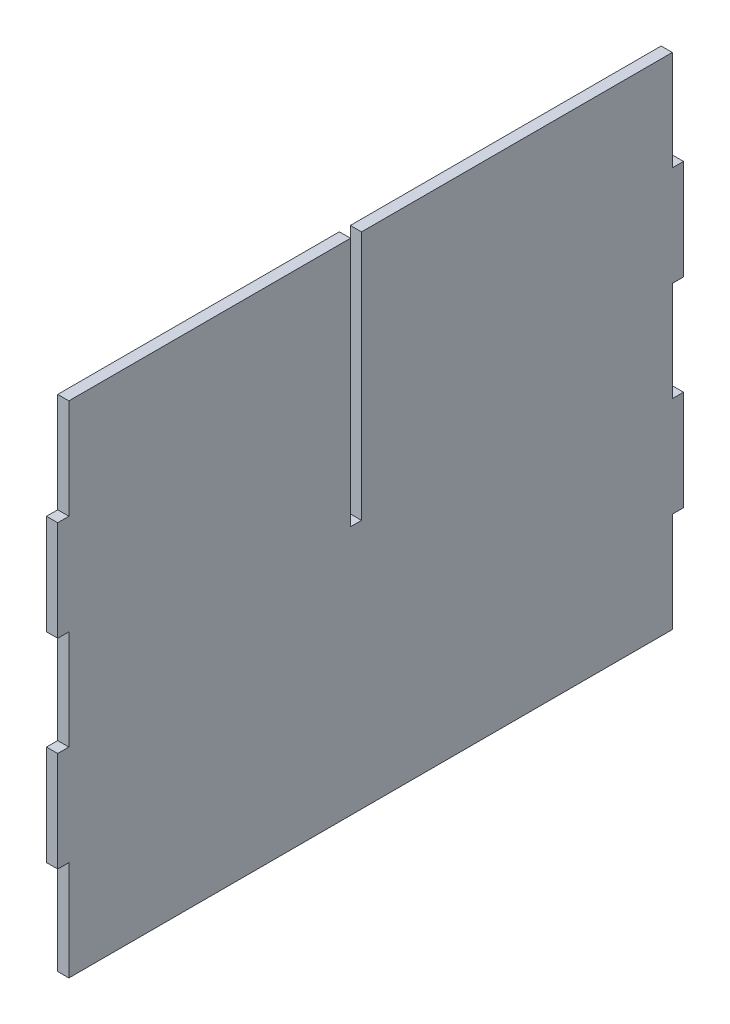
ISO-10303-21;
HEADER;
FILE_DESCRIPTION(('STEP AP214'),'2;1');
FILE_NAME('part.step','',(''),(''),'','','');
FILE_SCHEMA(('AUTOMOTIVE_DESIGN { 1 0 10303 214 1 1 1 1 }'));
ENDSEC;
DATA;
#1=APPLICATION_CONTEXT('core data for automotive mechanical design processes');
#2=APPLICATION_PROTOCOL_DEFINITION('international standard','automotive_design',2000,#1);
#3=PRODUCT_CONTEXT('',#1,'mechanical');
#4=PRODUCT('Part','Part','',(#3));
#5=PRODUCT_RELATED_PRODUCT_CATEGORY('part','',(#4));
#6=PRODUCT_DEFINITION_FORMATION('','',#4);
#7=PRODUCT_DEFINITION_CONTEXT('part definition',#1,'design');
#8=PRODUCT_DEFINITION('design','',#6,#7);
#9=PRODUCT_DEFINITION_SHAPE('','',#8);
#10=(LENGTH_UNIT() NAMED_UNIT(*) SI_UNIT(.MILLI.,.METRE.));
#11=(NAMED_UNIT(*) PLANE_ANGLE_UNIT() SI_UNIT($,.RADIAN.));
#12=(NAMED_UNIT(*) SI_UNIT($,.STERADIAN.) SOLID_ANGLE_UNIT());
#13=UNCERTAINTY_MEASURE_WITH_UNIT(LENGTH_MEASURE(1.E-05),#10,'distance_accuracy_value','');
#14=(GEOMETRIC_REPRESENTATION_CONTEXT(3) GLOBAL_UNCERTAINTY_ASSIGNED_CONTEXT((#13)) GLOBAL_UNIT_ASSIGNED_CONTEXT((#10,
#11,#12)) REPRESENTATION_CONTEXT('',''));
#15=CARTESIAN_POINT('',(0.,0.,0.));
#16=DIRECTION('',(0.,0.,1.));
#17=DIRECTION('',(1.,0.,0.));
#18=AXIS2_PLACEMENT_3D('',#15,#16,#17);
#19=CARTESIAN_POINT('',(-386.827934387987,-63.10064,148.42814));
#20=DIRECTION('',(0.,0.,1.));
#21=DIRECTION('',(1.,0.,0.));
#22=AXIS2_PLACEMENT_3D('',#19,#20,#21);
#23=PLANE('',#22);
#24=DIRECTION('',(0.,1.,0.));
#25=VECTOR('',#24,1.);
#26=CARTESIAN_POINT('',(0.,-63.10064,148.42814));
#27=LINE('',#26,#25);
#28=CARTESIAN_POINT('',(0.,-111.36564,148.42814));
#29=VERTEX_POINT('',#28);
#30=CARTESIAN_POINT('',(0.,-63.10064,148.42814));
#31=VERTEX_POINT('',#30);
#32=EDGE_CURVE('E50',#29,#31,#27,.T.);
#33=ORIENTED_EDGE('',*,*,#32,.F.);
#34=DIRECTION('',(1.,0.,0.));
#35=VECTOR('',#34,1.);
#36=CARTESIAN_POINT('',(-386.827934387987,-111.36564,148.42814));
#37=LINE('',#36,#35);
#38=CARTESIAN_POINT('',(5.4,-111.36564,148.42814));
#39=VERTEX_POINT('',#38);
#40=EDGE_CURVE('E201',#29,#39,#37,.T.);
#41=ORIENTED_EDGE('',*,*,#40,.T.);
#42=DIRECTION('',(0.,-1.,0.));
#43=VECTOR('',#42,1.);
#44=CARTESIAN_POINT('',(5.4,-63.10064,148.42814));
#45=LINE('',#44,#43);
#46=CARTESIAN_POINT('',(5.4,-63.10064,148.42814));
#47=VERTEX_POINT('',#46);
#48=EDGE_CURVE('E205',#47,#39,#45,.T.);
#49=ORIENTED_EDGE('',*,*,#48,.F.);
#50=DIRECTION('',(1.,0.,0.));
#51=VECTOR('',#50,1.);
#52=CARTESIAN_POINT('',(-386.827934387987,-63.10064,148.42814));
#53=LINE('',#52,#51);
#54=EDGE_CURVE('E313',#31,#47,#53,.T.);
#55=ORIENTED_EDGE('',*,*,#54,.F.);
#56=EDGE_LOOP('',(#33,#41,#49,#55));
#57=FACE_BOUND('',#56,.T.);
#58=ADVANCED_FACE('F41',(#57),#23,.T.);
#59=CARTESIAN_POINT('',(-386.827934387987,-63.10064,153.82814));
#60=DIRECTION('',(0.,-1.,0.));
#61=DIRECTION('',(0.,0.,-1.));
#62=AXIS2_PLACEMENT_3D('',#59,#60,#61);
#63=PLANE('',#62);
#64=DIRECTION('',(0.,0.,1.));
#65=VECTOR('',#64,1.);
#66=CARTESIAN_POINT('',(0.,-63.10064,153.82814));
#67=LINE('',#66,#65);
#68=CARTESIAN_POINT('',(0.,-63.10064,153.82814));
#69=VERTEX_POINT('',#68);
#70=EDGE_CURVE('E441',#31,#69,#67,.T.);
#71=ORIENTED_EDGE('',*,*,#70,.F.);
#72=ORIENTED_EDGE('',*,*,#54,.T.);
#73=DIRECTION('',(0.,0.,-1.));
#74=VECTOR('',#73,1.);
#75=CARTESIAN_POINT('',(5.4,-63.10064,153.82814));
#76=LINE('',#75,#74);
#77=CARTESIAN_POINT('',(5.4,-63.10064,153.82814));
#78=VERTEX_POINT('',#77);
#79=EDGE_CURVE('E211',#78,#47,#76,.T.);
#80=ORIENTED_EDGE('',*,*,#79,.F.);
#81=DIRECTION('',(1.,0.,0.));
#82=VECTOR('',#81,1.);
#83=CARTESIAN_POINT('',(-386.827934387987,-63.10064,153.82814));
#84=LINE('',#83,#82);
#85=EDGE_CURVE('E317',#69,#78,#84,.T.);
#86=ORIENTED_EDGE('',*,*,#85,.F.);
#87=EDGE_LOOP('',(#71,#72,#80,#86));
#88=FACE_BOUND('',#87,.T.);
#89=ADVANCED_FACE('F448',(#88),#63,.T.);
#90=CARTESIAN_POINT('',(-386.827934387987,-14.75436,153.82814));
#91=DIRECTION('',(0.,0.,1.));
#92=DIRECTION('',(1.,0.,0.));
#93=AXIS2_PLACEMENT_3D('',#90,#91,#92);
#94=PLANE('',#93);
#95=DIRECTION('',(0.,1.,0.));
#96=VECTOR('',#95,1.);
#97=CARTESIAN_POINT('',(0.,-14.75436,153.82814));
#98=LINE('',#97,#96);
#99=CARTESIAN_POINT('',(0.,-14.75436,153.82814));
#100=VERTEX_POINT('',#99);
#101=EDGE_CURVE('E438',#69,#100,#98,.T.);
#102=ORIENTED_EDGE('',*,*,#101,.F.);
#103=ORIENTED_EDGE('',*,*,#85,.T.);
#104=DIRECTION('',(0.,-1.,0.));
#105=VECTOR('',#104,1.);
#106=CARTESIAN_POINT('',(5.4,-14.75436,153.82814));
#107=LINE('',#106,#105);
#108=CARTESIAN_POINT('',(5.4,-14.75436,153.82814));
#109=VERTEX_POINT('',#108);
#110=EDGE_CURVE('E308',#109,#78,#107,.T.);
#111=ORIENTED_EDGE('',*,*,#110,.F.);
#112=DIRECTION('',(1.,0.,0.));
#113=VECTOR('',#112,1.);
#114=CARTESIAN_POINT('',(-386.827934387987,-14.75436,153.82814));
#115=LINE('',#114,#113);
#116=EDGE_CURVE('E320',#100,#109,#115,.T.);
#117=ORIENTED_EDGE('',*,*,#116,.F.);
#118=EDGE_LOOP('',(#102,#103,#111,#117));
#119=FACE_BOUND('',#118,.T.);
#120=ADVANCED_FACE('F451',(#119),#94,.T.);
#121=CARTESIAN_POINT('',(-386.827934387987,-14.75436,148.42814));
#122=DIRECTION('',(0.,1.,0.));
#123=DIRECTION('',(0.,0.,1.));
#124=AXIS2_PLACEMENT_3D('',#121,#122,#123);
#125=PLANE('',#124);
#126=DIRECTION('',(0.,0.,-1.));
#127=VECTOR('',#126,1.);
#128=CARTESIAN_POINT('',(0.,-14.75436,148.42814));
#129=LINE('',#128,#127);
#130=CARTESIAN_POINT('',(0.,-14.75436,148.42814));
#131=VERTEX_POINT('',#130);
#132=EDGE_CURVE('E435',#100,#131,#129,.T.);
#133=ORIENTED_EDGE('',*,*,#132,.F.);
#134=ORIENTED_EDGE('',*,*,#116,.T.);
#135=DIRECTION('',(0.,0.,1.));
#136=VECTOR('',#135,1.);
#137=CARTESIAN_POINT('',(5.4,-14.75436,148.42814));
#138=LINE('',#137,#136);
#139=CARTESIAN_POINT('',(5.4,-14.75436,148.42814));
#140=VERTEX_POINT('',#139);
#141=EDGE_CURVE('E304',#140,#109,#138,.T.);
#142=ORIENTED_EDGE('',*,*,#141,.F.);
#143=DIRECTION('',(1.,0.,0.));
#144=VECTOR('',#143,1.);
#145=CARTESIAN_POINT('',(-386.827934387987,-14.75436,148.42814));
#146=LINE('',#145,#144);
#147=EDGE_CURVE('E323',#131,#140,#146,.T.);
#148=ORIENTED_EDGE('',*,*,#147,.F.);
#149=EDGE_LOOP('',(#133,#134,#142,#148));
#150=FACE_BOUND('',#149,.T.);
#151=ADVANCED_FACE('F458',(#150),#125,.T.);
#152=CARTESIAN_POINT('',(-386.827934387987,33.42936,148.42814));
#153=DIRECTION('',(0.,0.,1.));
#154=DIRECTION('',(1.,0.,0.));
#155=AXIS2_PLACEMENT_3D('',#152,#153,#154);
#156=PLANE('',#155);
#157=DIRECTION('',(0.,1.,0.));
#158=VECTOR('',#157,1.);
#159=CARTESIAN_POINT('',(0.,33.42936,148.42814));
#160=LINE('',#159,#158);
#161=CARTESIAN_POINT('',(0.,33.42936,148.42814));
#162=VERTEX_POINT('',#161);
#163=EDGE_CURVE('E432',#131,#162,#160,.T.);
#164=ORIENTED_EDGE('',*,*,#163,.F.);
#165=ORIENTED_EDGE('',*,*,#147,.T.);
#166=DIRECTION('',(0.,-1.,0.));
#167=VECTOR('',#166,1.);
#168=CARTESIAN_POINT('',(5.4,33.42936,148.42814));
#169=LINE('',#168,#167);
#170=CARTESIAN_POINT('',(5.4,33.42936,148.42814));
#171=VERTEX_POINT('',#170);
#172=EDGE_CURVE('E300',#171,#140,#169,.T.);
#173=ORIENTED_EDGE('',*,*,#172,.F.);
#174=DIRECTION('',(1.,0.,0.));
#175=VECTOR('',#174,1.);
#176=CARTESIAN_POINT('',(-386.827934387987,33.42936,148.42814));
#177=LINE('',#176,#175);
#178=EDGE_CURVE('E326',#162,#171,#177,.T.);
#179=ORIENTED_EDGE('',*,*,#178,.F.);
#180=EDGE_LOOP('',(#164,#165,#173,#179));
#181=FACE_BOUND('',#180,.T.);
#182=ADVANCED_FACE('F463',(#181),#156,.T.);
#183=CARTESIAN_POINT('',(-386.827934387987,33.42936,153.82814));
#184=DIRECTION('',(0.,-1.,0.));
#185=DIRECTION('',(0.,0.,-1.));
#186=AXIS2_PLACEMENT_3D('',#183,#184,#185);
#187=PLANE('',#186);
#188=DIRECTION('',(0.,0.,1.));
#189=VECTOR('',#188,1.);
#190=CARTESIAN_POINT('',(0.,33.42936,153.82814));
#191=LINE('',#190,#189);
#192=CARTESIAN_POINT('',(0.,33.42936,153.82814));
#193=VERTEX_POINT('',#192);
#194=EDGE_CURVE('E429',#162,#193,#191,.T.);
#195=ORIENTED_EDGE('',*,*,#194,.F.);
#196=ORIENTED_EDGE('',*,*,#178,.T.);
#197=DIRECTION('',(0.,0.,-1.));
#198=VECTOR('',#197,1.);
#199=CARTESIAN_POINT('',(5.4,33.42936,153.82814));
#200=LINE('',#199,#198);
#201=CARTESIAN_POINT('',(5.4,33.42936,153.82814));
#202=VERTEX_POINT('',#201);
#203=EDGE_CURVE('E296',#202,#171,#200,.T.);
#204=ORIENTED_EDGE('',*,*,#203,.F.);
#205=DIRECTION('',(1.,0.,0.));
#206=VECTOR('',#205,1.);
#207=CARTESIAN_POINT('',(-386.827934387987,33.42936,153.82814));
#208=LINE('',#207,#206);
#209=EDGE_CURVE('E329',#193,#202,#208,.T.);
#210=ORIENTED_EDGE('',*,*,#209,.F.);
#211=EDGE_LOOP('',(#195,#196,#204,#210));
#212=FACE_BOUND('',#211,.T.);
#213=ADVANCED_FACE('F466',(#212),#187,.T.);
#214=CARTESIAN_POINT('',(-386.827934387987,81.77564,153.82814));
#215=DIRECTION('',(0.,0.,1.));
#216=DIRECTION('',(0.,-1.,0.));
#217=AXIS2_PLACEMENT_3D('',#214,#215,#216);
#218=PLANE('',#217);
#219=DIRECTION('',(0.,1.,0.));
#220=VECTOR('',#219,1.);
#221=CARTESIAN_POINT('',(0.,81.77564,153.82814));
#222=LINE('',#221,#220);
#223=CARTESIAN_POINT('',(0.,81.77564,153.82814));
#224=VERTEX_POINT('',#223);
#225=EDGE_CURVE('E426',#193,#224,#222,.T.);
#226=ORIENTED_EDGE('',*,*,#225,.F.);
#227=ORIENTED_EDGE('',*,*,#209,.T.);
#228=DIRECTION('',(0.,-1.,0.));
#229=VECTOR('',#228,1.);
#230=CARTESIAN_POINT('',(5.4,81.77564,153.82814));
#231=LINE('',#230,#229);
#232=CARTESIAN_POINT('',(5.4,81.77564,153.82814));
#233=VERTEX_POINT('',#232);
#234=EDGE_CURVE('E292',#233,#202,#231,.T.);
#235=ORIENTED_EDGE('',*,*,#234,.F.);
#236=DIRECTION('',(1.,0.,0.));
#237=VECTOR('',#236,1.);
#238=CARTESIAN_POINT('',(-386.827934387987,81.77564,153.82814));
#239=LINE('',#238,#237);
#240=EDGE_CURVE('E332',#224,#233,#239,.T.);
#241=ORIENTED_EDGE('',*,*,#240,.F.);
#242=EDGE_LOOP('',(#226,#227,#235,#241));
#243=FACE_BOUND('',#242,.T.);
#244=ADVANCED_FACE('F472',(#243),#218,.T.);
#245=CARTESIAN_POINT('',(-386.827934387987,81.77564,148.42814));
#246=DIRECTION('',(0.,1.,0.));
#247=DIRECTION('',(0.,0.,1.));
#248=AXIS2_PLACEMENT_3D('',#245,#246,#247);
#249=PLANE('',#248);
#250=DIRECTION('',(0.,0.,-1.));
#251=VECTOR('',#250,1.);
#252=CARTESIAN_POINT('',(0.,81.77564,148.42814));
#253=LINE('',#252,#251);
#254=CARTESIAN_POINT('',(0.,81.77564,148.42814));
#255=VERTEX_POINT('',#254);
#256=EDGE_CURVE('E423',#224,#255,#253,.T.);
#257=ORIENTED_EDGE('',*,*,#256,.F.);
#258=ORIENTED_EDGE('',*,*,#240,.T.);
#259=DIRECTION('',(0.,0.,1.));
#260=VECTOR('',#259,1.);
#261=CARTESIAN_POINT('',(5.4,81.77564,148.42814));
#262=LINE('',#261,#260);
#263=CARTESIAN_POINT('',(5.4,81.77564,148.42814));
#264=VERTEX_POINT('',#263);
#265=EDGE_CURVE('E288',#264,#233,#262,.T.);
#266=ORIENTED_EDGE('',*,*,#265,.F.);
#267=DIRECTION('',(1.,0.,0.));
#268=VECTOR('',#267,1.);
#269=CARTESIAN_POINT('',(-386.827934387987,81.77564,148.42814));
#270=LINE('',#269,#268);
#271=EDGE_CURVE('E335',#255,#264,#270,.T.);
#272=ORIENTED_EDGE('',*,*,#271,.F.);
#273=EDGE_LOOP('',(#257,#258,#266,#272));
#274=FACE_BOUND('',#273,.T.);
#275=ADVANCED_FACE('F476',(#274),#249,.T.);
#276=CARTESIAN_POINT('',(-386.827934387987,130.04064,148.42814));
#277=DIRECTION('',(0.,0.,1.));
#278=DIRECTION('',(1.,0.,0.));
#279=AXIS2_PLACEMENT_3D('',#276,#277,#278);
#280=PLANE('',#279);
#281=DIRECTION('',(0.,1.,0.));
#282=VECTOR('',#281,1.);
#283=CARTESIAN_POINT('',(0.,130.04064,148.42814));
#284=LINE('',#283,#282);
#285=CARTESIAN_POINT('',(0.,130.04064,148.42814));
#286=VERTEX_POINT('',#285);
#287=EDGE_CURVE('E420',#255,#286,#284,.T.);
#288=ORIENTED_EDGE('',*,*,#287,.F.);
#289=ORIENTED_EDGE('',*,*,#271,.T.);
#290=DIRECTION('',(0.,-1.,0.));
#291=VECTOR('',#290,1.);
#292=CARTESIAN_POINT('',(5.4,130.04064,148.42814));
#293=LINE('',#292,#291);
#294=CARTESIAN_POINT('',(5.4,130.04064,148.42814));
#295=VERTEX_POINT('',#294);
#296=EDGE_CURVE('E284',#295,#264,#293,.T.);
#297=ORIENTED_EDGE('',*,*,#296,.F.);
#298=DIRECTION('',(1.,0.,0.));
#299=VECTOR('',#298,1.);
#300=CARTESIAN_POINT('',(-386.827934387987,130.04064,148.42814));
#301=LINE('',#300,#299);
#302=EDGE_CURVE('E338',#286,#295,#301,.T.);
#303=ORIENTED_EDGE('',*,*,#302,.F.);
#304=EDGE_LOOP('',(#288,#289,#297,#303));
#305=FACE_BOUND('',#304,.T.);
#306=ADVANCED_FACE('F482',(#305),#280,.T.);
#307=CARTESIAN_POINT('',(-386.827934387987,130.04064,12.39686));
#308=DIRECTION('',(0.,1.,0.));
#309=DIRECTION('',(0.,0.,1.));
#310=AXIS2_PLACEMENT_3D('',#307,#308,#309);
#311=PLANE('',#310);
#312=DIRECTION('',(0.,0.,-1.));
#313=VECTOR('',#312,1.);
#314=CARTESIAN_POINT('',(0.,130.04064,12.39686));
#315=LINE('',#314,#313);
#316=CARTESIAN_POINT('',(0.,130.04064,12.39686));
#317=VERTEX_POINT('',#316);
#318=EDGE_CURVE('E417',#286,#317,#315,.T.);
#319=ORIENTED_EDGE('',*,*,#318,.F.);
#320=ORIENTED_EDGE('',*,*,#302,.T.);
#321=DIRECTION('',(0.,0.,1.));
#322=VECTOR('',#321,1.);
#323=CARTESIAN_POINT('',(5.4,130.04064,12.39686));
#324=LINE('',#323,#322);
#325=CARTESIAN_POINT('',(5.4,130.04064,12.39686));
#326=VERTEX_POINT('',#325);
#327=EDGE_CURVE('E280',#326,#295,#324,.T.);
#328=ORIENTED_EDGE('',*,*,#327,.F.);
#329=DIRECTION('',(1.,0.,0.));
#330=VECTOR('',#329,1.);
#331=CARTESIAN_POINT('',(-386.827934387987,130.04064,12.39686));
#332=LINE('',#331,#330);
#333=EDGE_CURVE('E341',#317,#326,#332,.T.);
#334=ORIENTED_EDGE('',*,*,#333,.F.);
#335=EDGE_LOOP('',(#319,#320,#328,#334));
#336=FACE_BOUND('',#335,.T.);
#337=ADVANCED_FACE('F486',(#336),#311,.T.);
#338=CARTESIAN_POINT('',(-386.827934387987,9.37814000000003,12.39686));
#339=DIRECTION('',(0.,0.,-1.));
#340=DIRECTION('',(0.,1.,0.));
#341=AXIS2_PLACEMENT_3D('',#338,#339,#340);
#342=PLANE('',#341);
#343=DIRECTION('',(0.,-1.,0.));
#344=VECTOR('',#343,1.);
#345=CARTESIAN_POINT('',(0.,9.37814000000003,12.39686));
#346=LINE('',#345,#344);
#347=CARTESIAN_POINT('',(0.,9.37814000000003,12.39686));
#348=VERTEX_POINT('',#347);
#349=EDGE_CURVE('E414',#317,#348,#346,.T.);
#350=ORIENTED_EDGE('',*,*,#349,.F.);
#351=ORIENTED_EDGE('',*,*,#333,.T.);
#352=DIRECTION('',(0.,1.,0.));
#353=VECTOR('',#352,1.);
#354=CARTESIAN_POINT('',(5.4,9.37814000000003,12.39686));
#355=LINE('',#354,#353);
#356=CARTESIAN_POINT('',(5.4,9.37814000000003,12.39686));
#357=VERTEX_POINT('',#356);
#358=EDGE_CURVE('E276',#357,#326,#355,.T.);
#359=ORIENTED_EDGE('',*,*,#358,.F.);
#360=DIRECTION('',(1.,0.,0.));
#361=VECTOR('',#360,1.);
#362=CARTESIAN_POINT('',(-386.827934387987,9.37814000000003,12.39686));
#363=LINE('',#362,#361);
#364=EDGE_CURVE('E344',#348,#357,#363,.T.);
#365=ORIENTED_EDGE('',*,*,#364,.F.);
#366=EDGE_LOOP('',(#350,#351,#359,#365));
#367=FACE_BOUND('',#366,.T.);
#368=ADVANCED_FACE('F492',(#367),#342,.T.);
#369=CARTESIAN_POINT('',(-386.827934387987,9.37814000000003,7.07813999999998));
#370=DIRECTION('',(0.,1.,0.));
#371=DIRECTION('',(0.,0.,1.));
#372=AXIS2_PLACEMENT_3D('',#369,#370,#371);
#373=PLANE('',#372);
#374=DIRECTION('',(0.,0.,-1.));
#375=VECTOR('',#374,1.);
#376=CARTESIAN_POINT('',(0.,9.37814000000003,7.07813999999998));
#377=LINE('',#376,#375);
#378=CARTESIAN_POINT('',(0.,9.37814000000003,7.07813999999998));
#379=VERTEX_POINT('',#378);
#380=EDGE_CURVE('E411',#348,#379,#377,.T.);
#381=ORIENTED_EDGE('',*,*,#380,.F.);
#382=ORIENTED_EDGE('',*,*,#364,.T.);
#383=DIRECTION('',(0.,0.,1.));
#384=VECTOR('',#383,1.);
#385=CARTESIAN_POINT('',(5.4,9.37814000000003,7.07813999999998));
#386=LINE('',#385,#384);
#387=CARTESIAN_POINT('',(5.4,9.37814000000003,7.07813999999998));
#388=VERTEX_POINT('',#387);
#389=EDGE_CURVE('E272',#388,#357,#386,.T.);
#390=ORIENTED_EDGE('',*,*,#389,.F.);
#391=DIRECTION('',(1.,0.,0.));
#392=VECTOR('',#391,1.);
#393=CARTESIAN_POINT('',(-386.827934387987,9.37814000000003,7.07813999999998));
#394=LINE('',#393,#392);
#395=EDGE_CURVE('E347',#379,#388,#394,.T.);
#396=ORIENTED_EDGE('',*,*,#395,.F.);
#397=EDGE_LOOP('',(#381,#382,#390,#396));
#398=FACE_BOUND('',#397,.T.);
#399=ADVANCED_FACE('F496',(#398),#373,.T.);
#400=CARTESIAN_POINT('',(-386.827934387987,130.04064,7.07814));
#401=DIRECTION('',(0.,0.,1.));
#402=DIRECTION('',(0.,-1.,0.));
#403=AXIS2_PLACEMENT_3D('',#400,#401,#402);
#404=PLANE('',#403);
#405=DIRECTION('',(0.,1.,0.));
#406=VECTOR('',#405,1.);
#407=CARTESIAN_POINT('',(0.,130.04064,7.07814));
#408=LINE('',#407,#406);
#409=CARTESIAN_POINT('',(0.,130.04064,7.07814000000001));
#410=VERTEX_POINT('',#409);
#411=EDGE_CURVE('E408',#379,#410,#408,.T.);
#412=ORIENTED_EDGE('',*,*,#411,.F.);
#413=ORIENTED_EDGE('',*,*,#395,.T.);
#414=DIRECTION('',(0.,-1.,0.));
#415=VECTOR('',#414,1.);
#416=CARTESIAN_POINT('',(5.4,130.04064,7.07814));
#417=LINE('',#416,#415);
#418=CARTESIAN_POINT('',(5.4,130.04064,7.07814));
#419=VERTEX_POINT('',#418);
#420=EDGE_CURVE('E268',#419,#388,#417,.T.);
#421=ORIENTED_EDGE('',*,*,#420,.F.);
#422=DIRECTION('',(1.,0.,0.));
#423=VECTOR('',#422,1.);
#424=CARTESIAN_POINT('',(-386.827934387987,130.04064,7.07814));
#425=LINE('',#424,#423);
#426=EDGE_CURVE('E350',#410,#419,#425,.T.);
#427=ORIENTED_EDGE('',*,*,#426,.F.);
#428=EDGE_LOOP('',(#412,#413,#421,#427));
#429=FACE_BOUND('',#428,.T.);
#430=ADVANCED_FACE('F502',(#429),#404,.T.);
#431=CARTESIAN_POINT('',(-386.827934387987,130.04064,-143.02814));
#432=DIRECTION('',(0.,1.,0.));
#433=DIRECTION('',(0.,0.,1.));
#434=AXIS2_PLACEMENT_3D('',#431,#432,#433);
#435=PLANE('',#434);
#436=DIRECTION('',(0.,0.,-1.));
#437=VECTOR('',#436,1.);
#438=CARTESIAN_POINT('',(0.,130.04064,-143.02814));
#439=LINE('',#438,#437);
#440=CARTESIAN_POINT('',(0.,130.04064,-143.02814));
#441=VERTEX_POINT('',#440);
#442=EDGE_CURVE('E405',#410,#441,#439,.T.);
#443=ORIENTED_EDGE('',*,*,#442,.F.);
#444=ORIENTED_EDGE('',*,*,#426,.T.);
#445=DIRECTION('',(0.,0.,1.));
#446=VECTOR('',#445,1.);
#447=CARTESIAN_POINT('',(5.4,130.04064,-143.02814));
#448=LINE('',#447,#446);
#449=CARTESIAN_POINT('',(5.4,130.04064,-143.02814));
#450=VERTEX_POINT('',#449);
#451=EDGE_CURVE('E264',#450,#419,#448,.T.);
#452=ORIENTED_EDGE('',*,*,#451,.F.);
#453=DIRECTION('',(1.,0.,0.));
#454=VECTOR('',#453,1.);
#455=CARTESIAN_POINT('',(-386.827934387987,130.04064,-143.02814));
#456=LINE('',#455,#454);
#457=EDGE_CURVE('E353',#441,#450,#456,.T.);
#458=ORIENTED_EDGE('',*,*,#457,.F.);
#459=EDGE_LOOP('',(#443,#444,#452,#458));
#460=FACE_BOUND('',#459,.T.);
#461=ADVANCED_FACE('F506',(#460),#435,.T.);
#462=CARTESIAN_POINT('',(-386.827934387987,81.7756400000002,-143.02814));
#463=DIRECTION('',(0.,0.,-1.));
#464=DIRECTION('',(0.,1.,0.));
#465=AXIS2_PLACEMENT_3D('',#462,#463,#464);
#466=PLANE('',#465);
#467=DIRECTION('',(0.,-1.,0.));
#468=VECTOR('',#467,1.);
#469=CARTESIAN_POINT('',(0.,81.7756400000002,-143.02814));
#470=LINE('',#469,#468);
#471=CARTESIAN_POINT('',(0.,81.7756400000002,-143.02814));
#472=VERTEX_POINT('',#471);
#473=EDGE_CURVE('E402',#441,#472,#470,.T.);
#474=ORIENTED_EDGE('',*,*,#473,.F.);
#475=ORIENTED_EDGE('',*,*,#457,.T.);
#476=DIRECTION('',(0.,1.,0.));
#477=VECTOR('',#476,1.);
#478=CARTESIAN_POINT('',(5.4,81.7756400000002,-143.02814));
#479=LINE('',#478,#477);
#480=CARTESIAN_POINT('',(5.4,81.7756400000002,-143.02814));
#481=VERTEX_POINT('',#480);
#482=EDGE_CURVE('E260',#481,#450,#479,.T.);
#483=ORIENTED_EDGE('',*,*,#482,.F.);
#484=DIRECTION('',(1.,0.,0.));
#485=VECTOR('',#484,1.);
#486=CARTESIAN_POINT('',(-386.827934387987,81.7756400000002,-143.02814));
#487=LINE('',#486,#485);
#488=EDGE_CURVE('E356',#472,#481,#487,.T.);
#489=ORIENTED_EDGE('',*,*,#488,.F.);
#490=EDGE_LOOP('',(#474,#475,#483,#489));
#491=FACE_BOUND('',#490,.T.);
#492=ADVANCED_FACE('F512',(#491),#466,.T.);
#493=CARTESIAN_POINT('',(-386.827934387987,81.7756400000002,-148.42814));
#494=DIRECTION('',(0.,1.,0.));
#495=DIRECTION('',(0.,0.,1.));
#496=AXIS2_PLACEMENT_3D('',#493,#494,#495);
#497=PLANE('',#496);
#498=DIRECTION('',(0.,0.,-1.));
#499=VECTOR('',#498,1.);
#500=CARTESIAN_POINT('',(0.,81.7756400000002,-148.42814));
#501=LINE('',#500,#499);
#502=CARTESIAN_POINT('',(0.,81.7756400000002,-148.42814));
#503=VERTEX_POINT('',#502);
#504=EDGE_CURVE('E399',#472,#503,#501,.T.);
#505=ORIENTED_EDGE('',*,*,#504,.F.);
#506=ORIENTED_EDGE('',*,*,#488,.T.);
#507=DIRECTION('',(0.,0.,1.));
#508=VECTOR('',#507,1.);
#509=CARTESIAN_POINT('',(5.4,81.7756400000002,-148.42814));
#510=LINE('',#509,#508);
#511=CARTESIAN_POINT('',(5.4,81.7756400000002,-148.42814));
#512=VERTEX_POINT('',#511);
#513=EDGE_CURVE('E256',#512,#481,#510,.T.);
#514=ORIENTED_EDGE('',*,*,#513,.F.);
#515=DIRECTION('',(1.,0.,0.));
#516=VECTOR('',#515,1.);
#517=CARTESIAN_POINT('',(-386.827934387987,81.7756400000002,-148.42814));
#518=LINE('',#517,#516);
#519=EDGE_CURVE('E359',#503,#512,#518,.T.);
#520=ORIENTED_EDGE('',*,*,#519,.F.);
#521=EDGE_LOOP('',(#505,#506,#514,#520));
#522=FACE_BOUND('',#521,.T.);
#523=ADVANCED_FACE('F516',(#522),#497,.T.);
#524=CARTESIAN_POINT('',(-386.827934387987,33.4293600000002,-148.42814));
#525=DIRECTION('',(0.,0.,-1.));
#526=DIRECTION('',(-1.,0.,0.));
#527=AXIS2_PLACEMENT_3D('',#524,#525,#526);
#528=PLANE('',#527);
#529=DIRECTION('',(0.,-1.,0.));
#530=VECTOR('',#529,1.);
#531=CARTESIAN_POINT('',(0.,33.4293600000002,-148.42814));
#532=LINE('',#531,#530);
#533=CARTESIAN_POINT('',(0.,33.4293600000002,-148.42814));
#534=VERTEX_POINT('',#533);
#535=EDGE_CURVE('E396',#503,#534,#532,.T.);
#536=ORIENTED_EDGE('',*,*,#535,.F.);
#537=ORIENTED_EDGE('',*,*,#519,.T.);
#538=DIRECTION('',(0.,1.,0.));
#539=VECTOR('',#538,1.);
#540=CARTESIAN_POINT('',(5.4,33.4293600000002,-148.42814));
#541=LINE('',#540,#539);
#542=CARTESIAN_POINT('',(5.4,33.4293600000002,-148.42814));
#543=VERTEX_POINT('',#542);
#544=EDGE_CURVE('E252',#543,#512,#541,.T.);
#545=ORIENTED_EDGE('',*,*,#544,.F.);
#546=DIRECTION('',(1.,0.,0.));
#547=VECTOR('',#546,1.);
#548=CARTESIAN_POINT('',(-386.827934387987,33.4293600000002,-148.42814));
#549=LINE('',#548,#547);
#550=EDGE_CURVE('E362',#534,#543,#549,.T.);
#551=ORIENTED_EDGE('',*,*,#550,.F.);
#552=EDGE_LOOP('',(#536,#537,#545,#551));
#553=FACE_BOUND('',#552,.T.);
#554=ADVANCED_FACE('F522',(#553),#528,.T.);
#555=CARTESIAN_POINT('',(-386.827934387987,33.4293600000002,-143.02814));
#556=DIRECTION('',(0.,-1.,0.));
#557=DIRECTION('',(0.,0.,-1.));
#558=AXIS2_PLACEMENT_3D('',#555,#556,#557);
#559=PLANE('',#558);
#560=DIRECTION('',(0.,0.,1.));
#561=VECTOR('',#560,1.);
#562=CARTESIAN_POINT('',(0.,33.4293600000002,-143.02814));
#563=LINE('',#562,#561);
#564=CARTESIAN_POINT('',(0.,33.4293600000002,-143.02814));
#565=VERTEX_POINT('',#564);
#566=EDGE_CURVE('E393',#534,#565,#563,.T.);
#567=ORIENTED_EDGE('',*,*,#566,.F.);
#568=ORIENTED_EDGE('',*,*,#550,.T.);
#569=DIRECTION('',(0.,0.,-1.));
#570=VECTOR('',#569,1.);
#571=CARTESIAN_POINT('',(5.4,33.4293600000002,-143.02814));
#572=LINE('',#571,#570);
#573=CARTESIAN_POINT('',(5.4,33.4293600000002,-143.02814));
#574=VERTEX_POINT('',#573);
#575=EDGE_CURVE('E248',#574,#543,#572,.T.);
#576=ORIENTED_EDGE('',*,*,#575,.F.);
#577=DIRECTION('',(1.,0.,0.));
#578=VECTOR('',#577,1.);
#579=CARTESIAN_POINT('',(-386.827934387987,33.4293600000002,-143.02814));
#580=LINE('',#579,#578);
#581=EDGE_CURVE('E365',#565,#574,#580,.T.);
#582=ORIENTED_EDGE('',*,*,#581,.F.);
#583=EDGE_LOOP('',(#567,#568,#576,#582));
#584=FACE_BOUND('',#583,.T.);
#585=ADVANCED_FACE('F526',(#584),#559,.T.);
#586=CARTESIAN_POINT('',(-386.827934387987,-14.7543599999998,-143.02814));
#587=DIRECTION('',(0.,0.,-1.));
#588=DIRECTION('',(-1.,0.,0.));
#589=AXIS2_PLACEMENT_3D('',#586,#587,#588);
#590=PLANE('',#589);
#591=DIRECTION('',(0.,-1.,0.));
#592=VECTOR('',#591,1.);
#593=CARTESIAN_POINT('',(0.,-14.7543599999998,-143.02814));
#594=LINE('',#593,#592);
#595=CARTESIAN_POINT('',(0.,-14.7543599999998,-143.02814));
#596=VERTEX_POINT('',#595);
#597=EDGE_CURVE('E390',#565,#596,#594,.T.);
#598=ORIENTED_EDGE('',*,*,#597,.F.);
#599=ORIENTED_EDGE('',*,*,#581,.T.);
#600=DIRECTION('',(0.,1.,0.));
#601=VECTOR('',#600,1.);
#602=CARTESIAN_POINT('',(5.4,-14.7543599999998,-143.02814));
#603=LINE('',#602,#601);
#604=CARTESIAN_POINT('',(5.4,-14.7543599999998,-143.02814));
#605=VERTEX_POINT('',#604);
#606=EDGE_CURVE('E244',#605,#574,#603,.T.);
#607=ORIENTED_EDGE('',*,*,#606,.F.);
#608=DIRECTION('',(1.,0.,0.));
#609=VECTOR('',#608,1.);
#610=CARTESIAN_POINT('',(-386.827934387987,-14.7543599999998,-143.02814));
#611=LINE('',#610,#609);
#612=EDGE_CURVE('E368',#596,#605,#611,.T.);
#613=ORIENTED_EDGE('',*,*,#612,.F.);
#614=EDGE_LOOP('',(#598,#599,#607,#613));
#615=FACE_BOUND('',#614,.T.);
#616=ADVANCED_FACE('F532',(#615),#590,.T.);
#617=CARTESIAN_POINT('',(-386.827934387987,-14.7543599999998,-148.42814));
#618=DIRECTION('',(0.,1.,0.));
#619=DIRECTION('',(0.,0.,1.));
#620=AXIS2_PLACEMENT_3D('',#617,#618,#619);
#621=PLANE('',#620);
#622=DIRECTION('',(0.,0.,-1.));
#623=VECTOR('',#622,1.);
#624=CARTESIAN_POINT('',(0.,-14.7543599999998,-148.42814));
#625=LINE('',#624,#623);
#626=CARTESIAN_POINT('',(0.,-14.7543599999998,-148.42814));
#627=VERTEX_POINT('',#626);
#628=EDGE_CURVE('E387',#596,#627,#625,.T.);
#629=ORIENTED_EDGE('',*,*,#628,.F.);
#630=ORIENTED_EDGE('',*,*,#612,.T.);
#631=DIRECTION('',(0.,0.,1.));
#632=VECTOR('',#631,1.);
#633=CARTESIAN_POINT('',(5.4,-14.7543599999998,-148.42814));
#634=LINE('',#633,#632);
#635=CARTESIAN_POINT('',(5.4,-14.7543599999998,-148.42814));
#636=VERTEX_POINT('',#635);
#637=EDGE_CURVE('E240',#636,#605,#634,.T.);
#638=ORIENTED_EDGE('',*,*,#637,.F.);
#639=DIRECTION('',(1.,0.,0.));
#640=VECTOR('',#639,1.);
#641=CARTESIAN_POINT('',(-386.827934387987,-14.7543599999998,-148.42814));
#642=LINE('',#641,#640);
#643=EDGE_CURVE('E371',#627,#636,#642,.T.);
#644=ORIENTED_EDGE('',*,*,#643,.F.);
#645=EDGE_LOOP('',(#629,#630,#638,#644));
#646=FACE_BOUND('',#645,.T.);
#647=ADVANCED_FACE('F536',(#646),#621,.T.);
#648=CARTESIAN_POINT('',(-386.827934387987,-63.1006399999998,-148.42814));
#649=DIRECTION('',(0.,0.,-1.));
#650=DIRECTION('',(0.,1.,0.));
#651=AXIS2_PLACEMENT_3D('',#648,#649,#650);
#652=PLANE('',#651);
#653=DIRECTION('',(0.,-1.,0.));
#654=VECTOR('',#653,1.);
#655=CARTESIAN_POINT('',(0.,-63.1006399999998,-148.42814));
#656=LINE('',#655,#654);
#657=CARTESIAN_POINT('',(0.,-63.1006399999998,-148.42814));
#658=VERTEX_POINT('',#657);
#659=EDGE_CURVE('E62',#627,#658,#656,.T.);
#660=ORIENTED_EDGE('',*,*,#659,.F.);
#661=ORIENTED_EDGE('',*,*,#643,.T.);
#662=DIRECTION('',(0.,1.,0.));
#663=VECTOR('',#662,1.);
#664=CARTESIAN_POINT('',(5.4,-63.1006399999998,-148.42814));
#665=LINE('',#664,#663);
#666=CARTESIAN_POINT('',(5.4,-63.1006399999998,-148.42814));
#667=VERTEX_POINT('',#666);
#668=EDGE_CURVE('E236',#667,#636,#665,.T.);
#669=ORIENTED_EDGE('',*,*,#668,.F.);
#670=DIRECTION('',(1.,0.,0.));
#671=VECTOR('',#670,1.);
#672=CARTESIAN_POINT('',(-386.827934387987,-63.1006399999998,-148.42814));
#673=LINE('',#672,#671);
#674=EDGE_CURVE('E374',#658,#667,#673,.T.);
#675=ORIENTED_EDGE('',*,*,#674,.F.);
#676=EDGE_LOOP('',(#660,#661,#669,#675));
#677=FACE_BOUND('',#676,.T.);
#678=ADVANCED_FACE('F540',(#677),#652,.T.);
#679=CARTESIAN_POINT('',(-386.827934387987,-63.1006399999998,-143.02814));
#680=DIRECTION('',(0.,-1.,0.));
#681=DIRECTION('',(0.,0.,-1.));
#682=AXIS2_PLACEMENT_3D('',#679,#680,#681);
#683=PLANE('',#682);
#684=DIRECTION('',(0.,0.,1.));
#685=VECTOR('',#684,1.);
#686=CARTESIAN_POINT('',(0.,-63.1006399999998,-143.02814));
#687=LINE('',#686,#685);
#688=CARTESIAN_POINT('',(0.,-63.1006399999998,-143.02814));
#689=VERTEX_POINT('',#688);
#690=EDGE_CURVE('E57',#658,#689,#687,.T.);
#691=ORIENTED_EDGE('',*,*,#690,.F.);
#692=ORIENTED_EDGE('',*,*,#674,.T.);
#693=DIRECTION('',(0.,0.,-1.));
#694=VECTOR('',#693,1.);
#695=CARTESIAN_POINT('',(5.4,-63.1006399999998,-143.02814));
#696=LINE('',#695,#694);
#697=CARTESIAN_POINT('',(5.4,-63.1006399999998,-143.02814));
#698=VERTEX_POINT('',#697);
#699=EDGE_CURVE('E232',#698,#667,#696,.T.);
#700=ORIENTED_EDGE('',*,*,#699,.F.);
#701=DIRECTION('',(1.,0.,0.));
#702=VECTOR('',#701,1.);
#703=CARTESIAN_POINT('',(-386.827934387987,-63.1006399999998,-143.02814));
#704=LINE('',#703,#702);
#705=EDGE_CURVE('E377',#689,#698,#704,.T.);
#706=ORIENTED_EDGE('',*,*,#705,.F.);
#707=EDGE_LOOP('',(#691,#692,#700,#706));
#708=FACE_BOUND('',#707,.T.);
#709=ADVANCED_FACE('F544',(#708),#683,.T.);
#710=CARTESIAN_POINT('',(-386.827934387987,-111.36564,-143.02814));
#711=DIRECTION('',(0.,0.,-1.));
#712=DIRECTION('',(-1.,0.,0.));
#713=AXIS2_PLACEMENT_3D('',#710,#711,#712);
#714=PLANE('',#713);
#715=DIRECTION('',(0.,-1.,0.));
#716=VECTOR('',#715,1.);
#717=CARTESIAN_POINT('',(0.,-111.36564,-143.02814));
#718=LINE('',#717,#716);
#719=CARTESIAN_POINT('',(0.,-111.36564,-143.02814));
#720=VERTEX_POINT('',#719);
#721=EDGE_CURVE('E316',#689,#720,#718,.T.);
#722=ORIENTED_EDGE('',*,*,#721,.F.);
#723=ORIENTED_EDGE('',*,*,#705,.T.);
#724=DIRECTION('',(0.,1.,0.));
#725=VECTOR('',#724,1.);
#726=CARTESIAN_POINT('',(5.4,-111.36564,-143.02814));
#727=LINE('',#726,#725);
#728=CARTESIAN_POINT('',(5.4,-111.36564,-143.02814));
#729=VERTEX_POINT('',#728);
#730=EDGE_CURVE('E220',#729,#698,#727,.T.);
#731=ORIENTED_EDGE('',*,*,#730,.F.);
#732=DIRECTION('',(1.,0.,0.));
#733=VECTOR('',#732,1.);
#734=CARTESIAN_POINT('',(-386.827934387987,-111.36564,-143.02814));
#735=LINE('',#734,#733);
#736=EDGE_CURVE('E210',#720,#729,#735,.T.);
#737=ORIENTED_EDGE('',*,*,#736,.F.);
#738=EDGE_LOOP('',(#722,#723,#731,#737));
#739=FACE_BOUND('',#738,.T.);
#740=ADVANCED_FACE('F547',(#739),#714,.T.);
#741=CARTESIAN_POINT('',(-386.827934387987,-111.36564,148.42814));
#742=DIRECTION('',(0.,-1.,0.));
#743=DIRECTION('',(0.,0.,-1.));
#744=AXIS2_PLACEMENT_3D('',#741,#742,#743);
#745=PLANE('',#744);
#746=DIRECTION('',(0.,0.,1.));
#747=VECTOR('',#746,1.);
#748=CARTESIAN_POINT('',(0.,-111.36564,148.42814));
#749=LINE('',#748,#747);
#750=EDGE_CURVE('E11',#720,#29,#749,.T.);
#751=ORIENTED_EDGE('',*,*,#750,.F.);
#752=ORIENTED_EDGE('',*,*,#736,.T.);
#753=DIRECTION('',(0.,0.,-1.));
#754=VECTOR('',#753,1.);
#755=CARTESIAN_POINT('',(5.4,-111.36564,148.42814));
#756=LINE('',#755,#754);
#757=EDGE_CURVE('E213',#39,#729,#756,.T.);
#758=ORIENTED_EDGE('',*,*,#757,.F.);
#759=ORIENTED_EDGE('',*,*,#40,.F.);
#760=EDGE_LOOP('',(#751,#752,#758,#759));
#761=FACE_BOUND('',#760,.T.);
#762=ADVANCED_FACE('F214',(#761),#745,.T.);
#763=CARTESIAN_POINT('',(0.,0.,0.));
#764=DIRECTION('',(1.,0.,0.));
#765=DIRECTION('',(0.,0.,-1.));
#766=AXIS2_PLACEMENT_3D('',#763,#764,#765);
#767=PLANE('',#766);
#768=ORIENTED_EDGE('',*,*,#32,.T.);
#769=ORIENTED_EDGE('',*,*,#70,.T.);
#770=ORIENTED_EDGE('',*,*,#101,.T.);
#771=ORIENTED_EDGE('',*,*,#132,.T.);
#772=ORIENTED_EDGE('',*,*,#163,.T.);
#773=ORIENTED_EDGE('',*,*,#194,.T.);
#774=ORIENTED_EDGE('',*,*,#225,.T.);
#775=ORIENTED_EDGE('',*,*,#256,.T.);
#776=ORIENTED_EDGE('',*,*,#287,.T.);
#777=ORIENTED_EDGE('',*,*,#318,.T.);
#778=ORIENTED_EDGE('',*,*,#349,.T.);
#779=ORIENTED_EDGE('',*,*,#380,.T.);
#780=ORIENTED_EDGE('',*,*,#411,.T.);
#781=ORIENTED_EDGE('',*,*,#442,.T.);
#782=ORIENTED_EDGE('',*,*,#473,.T.);
#783=ORIENTED_EDGE('',*,*,#504,.T.);
#784=ORIENTED_EDGE('',*,*,#535,.T.);
#785=ORIENTED_EDGE('',*,*,#566,.T.);
#786=ORIENTED_EDGE('',*,*,#597,.T.);
#787=ORIENTED_EDGE('',*,*,#628,.T.);
#788=ORIENTED_EDGE('',*,*,#659,.T.);
#789=ORIENTED_EDGE('',*,*,#690,.T.);
#790=ORIENTED_EDGE('',*,*,#721,.T.);
#791=ORIENTED_EDGE('',*,*,#750,.T.);
#792=EDGE_LOOP('',(#768,#769,#770,#771,#772,#773,#774,#775,#776,#777,#778,#779,#780,#781,#782,
#783,#784,#785,#786,#787,#788,#789,#790,#791));
#793=FACE_BOUND('',#792,.T.);
#794=ADVANCED_FACE('F43',(#793),#767,.F.);
#795=CARTESIAN_POINT('',(5.4,0.,0.));
#796=DIRECTION('',(1.,0.,0.));
#797=DIRECTION('',(0.,0.,-1.));
#798=AXIS2_PLACEMENT_3D('',#795,#796,#797);
#799=PLANE('',#798);
#800=ORIENTED_EDGE('',*,*,#48,.T.);
#801=ORIENTED_EDGE('',*,*,#757,.T.);
#802=ORIENTED_EDGE('',*,*,#730,.T.);
#803=ORIENTED_EDGE('',*,*,#699,.T.);
#804=ORIENTED_EDGE('',*,*,#668,.T.);
#805=ORIENTED_EDGE('',*,*,#637,.T.);
#806=ORIENTED_EDGE('',*,*,#606,.T.);
#807=ORIENTED_EDGE('',*,*,#575,.T.);
#808=ORIENTED_EDGE('',*,*,#544,.T.);
#809=ORIENTED_EDGE('',*,*,#513,.T.);
#810=ORIENTED_EDGE('',*,*,#482,.T.);
#811=ORIENTED_EDGE('',*,*,#451,.T.);
#812=ORIENTED_EDGE('',*,*,#420,.T.);
#813=ORIENTED_EDGE('',*,*,#389,.T.);
#814=ORIENTED_EDGE('',*,*,#358,.T.);
#815=ORIENTED_EDGE('',*,*,#327,.T.);
#816=ORIENTED_EDGE('',*,*,#296,.T.);
#817=ORIENTED_EDGE('',*,*,#265,.T.);
#818=ORIENTED_EDGE('',*,*,#234,.T.);
#819=ORIENTED_EDGE('',*,*,#203,.T.);
#820=ORIENTED_EDGE('',*,*,#172,.T.);
#821=ORIENTED_EDGE('',*,*,#141,.T.);
#822=ORIENTED_EDGE('',*,*,#110,.T.);
#823=ORIENTED_EDGE('',*,*,#79,.T.);
#824=EDGE_LOOP('',(#800,#801,#802,#803,#804,#805,#806,#807,#808,#809,#810,#811,#812,#813,#814,
#815,#816,#817,#818,#819,#820,#821,#822,#823));
#825=FACE_BOUND('',#824,.T.);
#826=ADVANCED_FACE('F222',(#825),#799,.T.);
#827=CLOSED_SHELL('',(#58,#89,#120,#151,#182,#213,#244,#275,#306,#337,#368,#399,#430,#461,#492,
#523,#554,#585,#616,#647,#678,#709,#740,#762,#794,#826));
#828=MANIFOLD_SOLID_BREP('B2',#827);
#829=ADVANCED_BREP_SHAPE_REPRESENTATION('',(#18,#828),#14);
#830=SHAPE_DEFINITION_REPRESENTATION(#9,#829);
ENDSEC;
END-ISO-10303-21;
